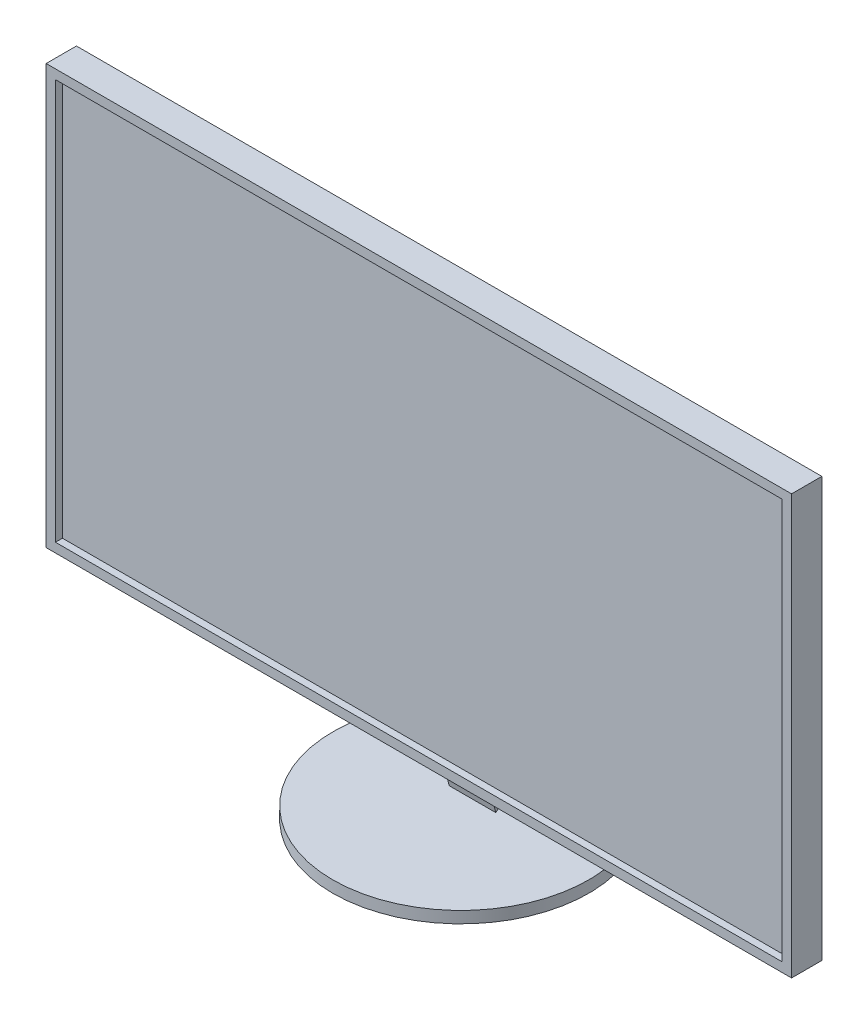
ISO-10303-21;
HEADER;
FILE_DESCRIPTION(('STEP AP214'),'2;1');
FILE_NAME('part.step','',(''),(''),'','','');
FILE_SCHEMA(('AUTOMOTIVE_DESIGN { 1 0 10303 214 1 1 1 1 }'));
ENDSEC;
DATA;
#1=APPLICATION_CONTEXT('core data for automotive mechanical design processes');
#2=APPLICATION_PROTOCOL_DEFINITION('international standard','automotive_design',2000,#1);
#3=PRODUCT_CONTEXT('',#1,'mechanical');
#4=PRODUCT('Part','Part','',(#3));
#5=PRODUCT_RELATED_PRODUCT_CATEGORY('part','',(#4));
#6=PRODUCT_DEFINITION_FORMATION('','',#4);
#7=PRODUCT_DEFINITION_CONTEXT('part definition',#1,'design');
#8=PRODUCT_DEFINITION('design','',#6,#7);
#9=PRODUCT_DEFINITION_SHAPE('','',#8);
#10=(LENGTH_UNIT() NAMED_UNIT(*) SI_UNIT(.MILLI.,.METRE.));
#11=(NAMED_UNIT(*) PLANE_ANGLE_UNIT() SI_UNIT($,.RADIAN.));
#12=(NAMED_UNIT(*) SI_UNIT($,.STERADIAN.) SOLID_ANGLE_UNIT());
#13=UNCERTAINTY_MEASURE_WITH_UNIT(LENGTH_MEASURE(1.E-05),#10,'distance_accuracy_value','');
#14=(GEOMETRIC_REPRESENTATION_CONTEXT(3) GLOBAL_UNCERTAINTY_ASSIGNED_CONTEXT((#13)) GLOBAL_UNIT_ASSIGNED_CONTEXT((#10,
#11,#12)) REPRESENTATION_CONTEXT('',''));
#15=CARTESIAN_POINT('',(0.,0.,0.));
#16=DIRECTION('',(0.,0.,1.));
#17=DIRECTION('',(1.,0.,0.));
#18=AXIS2_PLACEMENT_3D('',#15,#16,#17);
#19=CARTESIAN_POINT('',(80.,45.,2.5));
#20=DIRECTION('',(-1.,0.,0.));
#21=DIRECTION('',(0.,0.,1.));
#22=AXIS2_PLACEMENT_3D('',#19,#20,#21);
#23=PLANE('',#22);
#24=DIRECTION('',(0.,1.,0.));
#25=VECTOR('',#24,1.);
#26=CARTESIAN_POINT('',(80.,45.,-2.5));
#27=LINE('',#26,#25);
#28=CARTESIAN_POINT('',(80.,-45.,-2.5));
#29=VERTEX_POINT('',#28);
#30=CARTESIAN_POINT('',(80.,45.,-2.5));
#31=VERTEX_POINT('',#30);
#32=EDGE_CURVE('E224',#29,#31,#27,.T.);
#33=ORIENTED_EDGE('',*,*,#32,.T.);
#34=DIRECTION('',(0.,0.,-1.));
#35=VECTOR('',#34,1.);
#36=CARTESIAN_POINT('',(80.,45.,2.5));
#37=LINE('',#36,#35);
#38=CARTESIAN_POINT('',(80.,45.,4.));
#39=VERTEX_POINT('',#38);
#40=EDGE_CURVE('E12',#39,#31,#37,.T.);
#41=ORIENTED_EDGE('',*,*,#40,.F.);
#42=DIRECTION('',(0.,1.,0.));
#43=VECTOR('',#42,1.);
#44=CARTESIAN_POINT('',(80.,-45.,4.));
#45=LINE('',#44,#43);
#46=CARTESIAN_POINT('',(80.,-45.,4.));
#47=VERTEX_POINT('',#46);
#48=EDGE_CURVE('E208',#47,#39,#45,.T.);
#49=ORIENTED_EDGE('',*,*,#48,.F.);
#50=DIRECTION('',(0.,0.,-1.));
#51=VECTOR('',#50,1.);
#52=CARTESIAN_POINT('',(80.,-45.,2.5));
#53=LINE('',#52,#51);
#54=EDGE_CURVE('E237',#47,#29,#53,.T.);
#55=ORIENTED_EDGE('',*,*,#54,.T.);
#56=EDGE_LOOP('',(#33,#41,#49,#55));
#57=FACE_BOUND('',#56,.T.);
#58=ADVANCED_FACE('F45',(#57),#23,.F.);
#59=CARTESIAN_POINT('',(-80.,45.,2.5));
#60=DIRECTION('',(0.,-1.,0.));
#61=DIRECTION('',(0.,0.,-1.));
#62=AXIS2_PLACEMENT_3D('',#59,#60,#61);
#63=PLANE('',#62);
#64=DIRECTION('',(-1.,0.,0.));
#65=VECTOR('',#64,1.);
#66=CARTESIAN_POINT('',(-80.,45.,-2.5));
#67=LINE('',#66,#65);
#68=CARTESIAN_POINT('',(-80.,45.,-2.5));
#69=VERTEX_POINT('',#68);
#70=EDGE_CURVE('E228',#31,#69,#67,.T.);
#71=ORIENTED_EDGE('',*,*,#70,.T.);
#72=DIRECTION('',(0.,0.,-1.));
#73=VECTOR('',#72,1.);
#74=CARTESIAN_POINT('',(-80.,45.,2.5));
#75=LINE('',#74,#73);
#76=CARTESIAN_POINT('',(-80.,45.,4.));
#77=VERTEX_POINT('',#76);
#78=EDGE_CURVE('E54',#77,#69,#75,.T.);
#79=ORIENTED_EDGE('',*,*,#78,.F.);
#80=DIRECTION('',(-1.,0.,0.));
#81=VECTOR('',#80,1.);
#82=CARTESIAN_POINT('',(-80.,45.,4.));
#83=LINE('',#82,#81);
#84=EDGE_CURVE('E212',#39,#77,#83,.T.);
#85=ORIENTED_EDGE('',*,*,#84,.F.);
#86=ORIENTED_EDGE('',*,*,#40,.T.);
#87=EDGE_LOOP('',(#71,#79,#85,#86));
#88=FACE_BOUND('',#87,.T.);
#89=ADVANCED_FACE('F291',(#88),#63,.F.);
#90=CARTESIAN_POINT('',(-80.,45.,2.5));
#91=DIRECTION('',(1.,0.,0.));
#92=DIRECTION('',(0.,0.,-1.));
#93=AXIS2_PLACEMENT_3D('',#90,#91,#92);
#94=PLANE('',#93);
#95=DIRECTION('',(0.,-1.,0.));
#96=VECTOR('',#95,1.);
#97=CARTESIAN_POINT('',(-80.,45.,-2.5));
#98=LINE('',#97,#96);
#99=CARTESIAN_POINT('',(-80.,-45.,-2.5));
#100=VERTEX_POINT('',#99);
#101=EDGE_CURVE('E231',#69,#100,#98,.T.);
#102=ORIENTED_EDGE('',*,*,#101,.T.);
#103=DIRECTION('',(0.,0.,-1.));
#104=VECTOR('',#103,1.);
#105=CARTESIAN_POINT('',(-80.,-45.,2.5));
#106=LINE('',#105,#104);
#107=CARTESIAN_POINT('',(-80.,-45.,4.));
#108=VERTEX_POINT('',#107);
#109=EDGE_CURVE('E241',#108,#100,#106,.T.);
#110=ORIENTED_EDGE('',*,*,#109,.F.);
#111=DIRECTION('',(0.,-1.,0.));
#112=VECTOR('',#111,1.);
#113=CARTESIAN_POINT('',(-80.,-45.,4.));
#114=LINE('',#113,#112);
#115=EDGE_CURVE('E216',#77,#108,#114,.T.);
#116=ORIENTED_EDGE('',*,*,#115,.F.);
#117=ORIENTED_EDGE('',*,*,#78,.T.);
#118=EDGE_LOOP('',(#102,#110,#116,#117));
#119=FACE_BOUND('',#118,.T.);
#120=ADVANCED_FACE('F289',(#119),#94,.F.);
#121=CARTESIAN_POINT('',(-80.,-45.,2.5));
#122=DIRECTION('',(0.,1.,0.));
#123=DIRECTION('',(0.,0.,1.));
#124=AXIS2_PLACEMENT_3D('',#121,#122,#123);
#125=PLANE('',#124);
#126=DIRECTION('',(1.,0.,0.));
#127=VECTOR('',#126,1.);
#128=CARTESIAN_POINT('',(-80.,-45.,-2.5));
#129=LINE('',#128,#127);
#130=EDGE_CURVE('E234',#100,#29,#129,.T.);
#131=ORIENTED_EDGE('',*,*,#130,.T.);
#132=ORIENTED_EDGE('',*,*,#54,.F.);
#133=DIRECTION('',(1.,0.,0.));
#134=VECTOR('',#133,1.);
#135=CARTESIAN_POINT('',(-80.,-45.,4.));
#136=LINE('',#135,#134);
#137=EDGE_CURVE('E220',#108,#47,#136,.T.);
#138=ORIENTED_EDGE('',*,*,#137,.F.);
#139=ORIENTED_EDGE('',*,*,#109,.T.);
#140=EDGE_LOOP('',(#131,#132,#138,#139));
#141=FACE_BOUND('',#140,.T.);
#142=ADVANCED_FACE('F275',(#141),#125,.F.);
#143=CARTESIAN_POINT('',(0.,0.,-2.5));
#144=DIRECTION('',(0.,0.,1.));
#145=DIRECTION('',(1.,0.,0.));
#146=AXIS2_PLACEMENT_3D('',#143,#144,#145);
#147=PLANE('',#146);
#148=DIRECTION('',(0.316227766016838,-0.948683298050514,0.));
#149=VECTOR('',#148,1.);
#150=CARTESIAN_POINT('',(0.,-22.5,-2.5));
#151=LINE('',#150,#149);
#152=CARTESIAN_POINT('',(0.,-22.5,-2.5));
#153=VERTEX_POINT('',#152);
#154=CARTESIAN_POINT('',(5.,-37.5,-2.5));
#155=VERTEX_POINT('',#154);
#156=EDGE_CURVE('E150',#153,#155,#151,.T.);
#157=ORIENTED_EDGE('',*,*,#156,.F.);
#158=DIRECTION('',(0.316227766016838,0.948683298050514,0.));
#159=VECTOR('',#158,1.);
#160=CARTESIAN_POINT('',(-5.,-37.5,-2.5));
#161=LINE('',#160,#159);
#162=CARTESIAN_POINT('',(-5.,-37.5,-2.5));
#163=VERTEX_POINT('',#162);
#164=EDGE_CURVE('E248',#163,#153,#161,.T.);
#165=ORIENTED_EDGE('',*,*,#164,.F.);
#166=DIRECTION('',(-1.,0.,0.));
#167=VECTOR('',#166,1.);
#168=CARTESIAN_POINT('',(5.,-37.5,-2.5));
#169=LINE('',#168,#167);
#170=EDGE_CURVE('E156',#155,#163,#169,.T.);
#171=ORIENTED_EDGE('',*,*,#170,.F.);
#172=EDGE_LOOP('',(#157,#165,#171));
#173=FACE_BOUND('',#172,.T.);
#174=ORIENTED_EDGE('',*,*,#32,.F.);
#175=ORIENTED_EDGE('',*,*,#130,.F.);
#176=ORIENTED_EDGE('',*,*,#101,.F.);
#177=ORIENTED_EDGE('',*,*,#70,.F.);
#178=EDGE_LOOP('',(#174,#175,#176,#177));
#179=FACE_BOUND('',#178,.T.);
#180=ADVANCED_FACE('F271',(#173,#179),#147,.F.);
#181=CARTESIAN_POINT('',(0.,0.,4.));
#182=DIRECTION('',(0.,0.,-1.));
#183=DIRECTION('',(-1.,0.,0.));
#184=AXIS2_PLACEMENT_3D('',#181,#182,#183);
#185=PLANE('',#184);
#186=ORIENTED_EDGE('',*,*,#48,.T.);
#187=ORIENTED_EDGE('',*,*,#84,.T.);
#188=ORIENTED_EDGE('',*,*,#115,.T.);
#189=ORIENTED_EDGE('',*,*,#137,.T.);
#190=EDGE_LOOP('',(#186,#187,#188,#189));
#191=FACE_BOUND('',#190,.T.);
#192=DIRECTION('',(0.,1.,0.));
#193=VECTOR('',#192,1.);
#194=CARTESIAN_POINT('',(78.,43.,4.));
#195=LINE('',#194,#193);
#196=CARTESIAN_POINT('',(78.,-43.,4.));
#197=VERTEX_POINT('',#196);
#198=CARTESIAN_POINT('',(78.,43.,4.));
#199=VERTEX_POINT('',#198);
#200=EDGE_CURVE('E168',#197,#199,#195,.T.);
#201=ORIENTED_EDGE('',*,*,#200,.F.);
#202=DIRECTION('',(1.,0.,0.));
#203=VECTOR('',#202,1.);
#204=CARTESIAN_POINT('',(-78.,-43.,4.));
#205=LINE('',#204,#203);
#206=CARTESIAN_POINT('',(-78.,-43.,4.));
#207=VERTEX_POINT('',#206);
#208=EDGE_CURVE('E179',#207,#197,#205,.T.);
#209=ORIENTED_EDGE('',*,*,#208,.F.);
#210=DIRECTION('',(0.,-1.,0.));
#211=VECTOR('',#210,1.);
#212=CARTESIAN_POINT('',(-78.,43.,4.));
#213=LINE('',#212,#211);
#214=CARTESIAN_POINT('',(-78.,43.,4.));
#215=VERTEX_POINT('',#214);
#216=EDGE_CURVE('E175',#215,#207,#213,.T.);
#217=ORIENTED_EDGE('',*,*,#216,.F.);
#218=DIRECTION('',(-1.,0.,0.));
#219=VECTOR('',#218,1.);
#220=CARTESIAN_POINT('',(-78.,43.,4.));
#221=LINE('',#220,#219);
#222=EDGE_CURVE('E171',#199,#215,#221,.T.);
#223=ORIENTED_EDGE('',*,*,#222,.F.);
#224=EDGE_LOOP('',(#201,#209,#217,#223));
#225=FACE_BOUND('',#224,.T.);
#226=ADVANCED_FACE('F274',(#191,#225),#185,.F.);
#227=CARTESIAN_POINT('',(78.,43.,4.));
#228=DIRECTION('',(-1.,0.,0.));
#229=DIRECTION('',(0.,0.,1.));
#230=AXIS2_PLACEMENT_3D('',#227,#228,#229);
#231=PLANE('',#230);
#232=DIRECTION('',(0.,1.,0.));
#233=VECTOR('',#232,1.);
#234=CARTESIAN_POINT('',(78.,43.,2.5));
#235=LINE('',#234,#233);
#236=CARTESIAN_POINT('',(78.,-43.,2.5));
#237=VERTEX_POINT('',#236);
#238=CARTESIAN_POINT('',(78.,43.,2.5));
#239=VERTEX_POINT('',#238);
#240=EDGE_CURVE('E70',#237,#239,#235,.T.);
#241=ORIENTED_EDGE('',*,*,#240,.F.);
#242=DIRECTION('',(0.,0.,-1.));
#243=VECTOR('',#242,1.);
#244=CARTESIAN_POINT('',(78.,-43.,4.));
#245=LINE('',#244,#243);
#246=EDGE_CURVE('E182',#197,#237,#245,.T.);
#247=ORIENTED_EDGE('',*,*,#246,.F.);
#248=ORIENTED_EDGE('',*,*,#200,.T.);
#249=DIRECTION('',(0.,0.,-1.));
#250=VECTOR('',#249,1.);
#251=CARTESIAN_POINT('',(78.,43.,4.));
#252=LINE('',#251,#250);
#253=EDGE_CURVE('E204',#199,#239,#252,.T.);
#254=ORIENTED_EDGE('',*,*,#253,.T.);
#255=EDGE_LOOP('',(#241,#247,#248,#254));
#256=FACE_BOUND('',#255,.T.);
#257=ADVANCED_FACE('F307',(#256),#231,.T.);
#258=CARTESIAN_POINT('',(-78.,43.,4.));
#259=DIRECTION('',(0.,-1.,0.));
#260=DIRECTION('',(0.,0.,-1.));
#261=AXIS2_PLACEMENT_3D('',#258,#259,#260);
#262=PLANE('',#261);
#263=DIRECTION('',(-1.,0.,0.));
#264=VECTOR('',#263,1.);
#265=CARTESIAN_POINT('',(-78.,43.,2.5));
#266=LINE('',#265,#264);
#267=CARTESIAN_POINT('',(-78.,43.,2.5));
#268=VERTEX_POINT('',#267);
#269=EDGE_CURVE('E185',#239,#268,#266,.T.);
#270=ORIENTED_EDGE('',*,*,#269,.F.);
#271=ORIENTED_EDGE('',*,*,#253,.F.);
#272=ORIENTED_EDGE('',*,*,#222,.T.);
#273=DIRECTION('',(0.,0.,-1.));
#274=VECTOR('',#273,1.);
#275=CARTESIAN_POINT('',(-78.,43.,4.));
#276=LINE('',#275,#274);
#277=EDGE_CURVE('E200',#215,#268,#276,.T.);
#278=ORIENTED_EDGE('',*,*,#277,.T.);
#279=EDGE_LOOP('',(#270,#271,#272,#278));
#280=FACE_BOUND('',#279,.T.);
#281=ADVANCED_FACE('F310',(#280),#262,.T.);
#282=CARTESIAN_POINT('',(-78.,43.,4.));
#283=DIRECTION('',(1.,0.,0.));
#284=DIRECTION('',(0.,0.,-1.));
#285=AXIS2_PLACEMENT_3D('',#282,#283,#284);
#286=PLANE('',#285);
#287=DIRECTION('',(0.,-1.,0.));
#288=VECTOR('',#287,1.);
#289=CARTESIAN_POINT('',(-78.,43.,2.5));
#290=LINE('',#289,#288);
#291=CARTESIAN_POINT('',(-78.,-43.,2.5));
#292=VERTEX_POINT('',#291);
#293=EDGE_CURVE('E188',#268,#292,#290,.T.);
#294=ORIENTED_EDGE('',*,*,#293,.F.);
#295=ORIENTED_EDGE('',*,*,#277,.F.);
#296=ORIENTED_EDGE('',*,*,#216,.T.);
#297=DIRECTION('',(0.,0.,-1.));
#298=VECTOR('',#297,1.);
#299=CARTESIAN_POINT('',(-78.,-43.,4.));
#300=LINE('',#299,#298);
#301=EDGE_CURVE('E196',#207,#292,#300,.T.);
#302=ORIENTED_EDGE('',*,*,#301,.T.);
#303=EDGE_LOOP('',(#294,#295,#296,#302));
#304=FACE_BOUND('',#303,.T.);
#305=ADVANCED_FACE('F314',(#304),#286,.T.);
#306=CARTESIAN_POINT('',(-78.,-43.,4.));
#307=DIRECTION('',(0.,1.,0.));
#308=DIRECTION('',(0.,0.,1.));
#309=AXIS2_PLACEMENT_3D('',#306,#307,#308);
#310=PLANE('',#309);
#311=DIRECTION('',(1.,0.,0.));
#312=VECTOR('',#311,1.);
#313=CARTESIAN_POINT('',(-78.,-43.,2.5));
#314=LINE('',#313,#312);
#315=EDGE_CURVE('E172',#292,#237,#314,.T.);
#316=ORIENTED_EDGE('',*,*,#315,.F.);
#317=ORIENTED_EDGE('',*,*,#301,.F.);
#318=ORIENTED_EDGE('',*,*,#208,.T.);
#319=ORIENTED_EDGE('',*,*,#246,.T.);
#320=EDGE_LOOP('',(#316,#317,#318,#319));
#321=FACE_BOUND('',#320,.T.);
#322=ADVANCED_FACE('F304',(#321),#310,.T.);
#323=CARTESIAN_POINT('',(0.,0.,2.5));
#324=DIRECTION('',(0.,0.,1.));
#325=DIRECTION('',(1.,0.,0.));
#326=AXIS2_PLACEMENT_3D('',#323,#324,#325);
#327=PLANE('',#326);
#328=ORIENTED_EDGE('',*,*,#240,.T.);
#329=ORIENTED_EDGE('',*,*,#269,.T.);
#330=ORIENTED_EDGE('',*,*,#293,.T.);
#331=ORIENTED_EDGE('',*,*,#315,.T.);
#332=EDGE_LOOP('',(#328,#329,#330,#331));
#333=FACE_BOUND('',#332,.T.);
#334=ADVANCED_FACE('F301',(#333),#327,.T.);
#335=CARTESIAN_POINT('',(0.,-1.61764705882353,6.47058823529412));
#336=DIRECTION('',(0.,-0.242535625036333,0.970142500145332));
#337=DIRECTION('',(0.,-0.970142500145332,-0.242535625036333));
#338=AXIS2_PLACEMENT_3D('',#335,#336,#337);
#339=PLANE('',#338);
#340=DIRECTION('',(0.,-0.970142500145332,-0.242535625036333));
#341=VECTOR('',#340,1.);
#342=CARTESIAN_POINT('',(-5.,-37.5,-2.5));
#343=LINE('',#342,#341);
#344=CARTESIAN_POINT('',(-5.,-57.5,-7.5));
#345=VERTEX_POINT('',#344);
#346=EDGE_CURVE('E146',#163,#345,#343,.T.);
#347=ORIENTED_EDGE('',*,*,#346,.T.);
#348=DIRECTION('',(1.,0.,0.));
#349=VECTOR('',#348,1.);
#350=CARTESIAN_POINT('',(5.,-57.5,-7.5));
#351=LINE('',#350,#349);
#352=CARTESIAN_POINT('',(5.,-57.5,-7.5));
#353=VERTEX_POINT('',#352);
#354=EDGE_CURVE('E133',#345,#353,#351,.T.);
#355=ORIENTED_EDGE('',*,*,#354,.T.);
#356=DIRECTION('',(0.,-0.970142500145332,-0.242535625036333));
#357=VECTOR('',#356,1.);
#358=CARTESIAN_POINT('',(5.,-37.5,-2.5));
#359=LINE('',#358,#357);
#360=EDGE_CURVE('E144',#155,#353,#359,.T.);
#361=ORIENTED_EDGE('',*,*,#360,.F.);
#362=ORIENTED_EDGE('',*,*,#170,.T.);
#363=EDGE_LOOP('',(#347,#355,#361,#362));
#364=FACE_BOUND('',#363,.T.);
#365=ADVANCED_FACE('F142',(#364),#339,.T.);
#366=CARTESIAN_POINT('',(0.,-22.5,-2.5));
#367=CARTESIAN_POINT('',(0.,-57.5,-19.5));
#368=CARTESIAN_POINT('',(0.833333333333331,-25.,-2.5));
#369=CARTESIAN_POINT('',(0.833333333333304,-57.5,-17.5000000000001));
#370=CARTESIAN_POINT('',(1.66666666666666,-27.5,-2.5));
#371=CARTESIAN_POINT('',(1.66666666666662,-57.5,-15.5000000000001));
#372=CARTESIAN_POINT('',(3.33333333333333,-32.5,-2.5));
#373=CARTESIAN_POINT('',(3.33333333333329,-57.5,-11.5000000000001));
#374=CARTESIAN_POINT('',(4.16666666666666,-35.,-2.5));
#375=CARTESIAN_POINT('',(4.16666666666664,-57.5,-9.50000000000007));
#376=CARTESIAN_POINT('',(5.,-37.5,-2.5));
#377=CARTESIAN_POINT('',(5.,-57.5,-7.5));
#378=B_SPLINE_SURFACE_WITH_KNOTS('',3,1,((#366,#367),(#368,#369),(#370,#371),(#372,#373),(#374,
#375),(#376,#377)),.UNSPECIFIED.,.F.,.F.,.F.,(4,2,4),(2,2),(0.,0.5,1.),(0.,1.),.UNSPECIFIED.);
#379=DIRECTION('',(-0.384615384615385,0.,-0.923076923076923));
#380=VECTOR('',#379,1.);
#381=CARTESIAN_POINT('',(0.,-57.5,-19.5));
#382=LINE('',#381,#380);
#383=CARTESIAN_POINT('',(0.,-57.5,-19.5));
#384=VERTEX_POINT('',#383);
#385=EDGE_CURVE('E129',#353,#384,#382,.T.);
#386=DIRECTION('',(0.,-0.899508158575998,-0.436903962736913));
#387=VECTOR('',#386,1.);
#388=CARTESIAN_POINT('',(0.,-40.,-11.));
#389=LINE('',#388,#387);
#390=EDGE_CURVE('E62',#153,#384,#389,.T.);
#391=ORIENTED_EDGE('',*,*,#156,.T.);
#392=ORIENTED_EDGE('',*,*,#360,.T.);
#393=ORIENTED_EDGE('',*,*,#385,.T.);
#394=ORIENTED_EDGE('',*,*,#390,.F.);
#395=EDGE_LOOP('',(#391,#392,#393,#394));
#396=FACE_BOUND('',#395,.T.);
#397=ADVANCED_FACE('F148',(#396),#378,.T.);
#398=CARTESIAN_POINT('',(-5.,-37.5,-2.5));
#399=CARTESIAN_POINT('',(-5.,-57.5,-7.5));
#400=CARTESIAN_POINT('',(-4.16666666666666,-35.,-2.5));
#401=CARTESIAN_POINT('',(-4.16666666666667,-57.5,-9.49999999999999));
#402=CARTESIAN_POINT('',(-3.33333333333332,-32.5,-2.5));
#403=CARTESIAN_POINT('',(-3.33333333333334,-57.5,-11.5));
#404=CARTESIAN_POINT('',(-1.66666666666665,-27.4999999999999,-2.5));
#405=CARTESIAN_POINT('',(-1.66666666666667,-57.5,-15.5));
#406=CARTESIAN_POINT('',(-0.833333333333323,-25.,-2.5));
#407=CARTESIAN_POINT('',(-0.833333333333338,-57.5,-17.5));
#408=CARTESIAN_POINT('',(0.,-22.5,-2.5));
#409=CARTESIAN_POINT('',(0.,-57.5,-19.5));
#410=B_SPLINE_SURFACE_WITH_KNOTS('',3,1,((#398,#399),(#400,#401),(#402,#403),(#404,#405),(#406,
#407),(#408,#409)),.UNSPECIFIED.,.F.,.F.,.F.,(4,2,4),(2,2),(0.,0.5,1.),(0.,1.),.UNSPECIFIED.);
#411=DIRECTION('',(-0.384615384615385,0.,0.923076923076923));
#412=VECTOR('',#411,1.);
#413=CARTESIAN_POINT('',(-5.,-57.5,-7.5));
#414=LINE('',#413,#412);
#415=EDGE_CURVE('E135',#384,#345,#414,.T.);
#416=ORIENTED_EDGE('',*,*,#164,.T.);
#417=ORIENTED_EDGE('',*,*,#390,.T.);
#418=ORIENTED_EDGE('',*,*,#415,.T.);
#419=ORIENTED_EDGE('',*,*,#346,.F.);
#420=EDGE_LOOP('',(#416,#417,#418,#419));
#421=FACE_BOUND('',#420,.T.);
#422=ADVANCED_FACE('F268',(#421),#410,.T.);
#423=CARTESIAN_POINT('',(0.,-57.5,-5.));
#424=DIRECTION('',(0.,-1.,0.));
#425=DIRECTION('',(0.,0.,-1.));
#426=AXIS2_PLACEMENT_3D('',#423,#424,#425);
#427=CYLINDRICAL_SURFACE('',#426,27.5);
#428=CARTESIAN_POINT('',(0.,-57.5,-5.));
#429=DIRECTION('',(0.,1.,0.));
#430=DIRECTION('',(0.,0.,1.));
#431=AXIS2_PLACEMENT_3D('',#428,#429,#430);
#432=CIRCLE('',#431,27.5);
#433=CARTESIAN_POINT('',(0.,-57.5,22.5));
#434=VERTEX_POINT('',#433);
#435=EDGE_CURVE('E251',#434,#434,#432,.T.);
#436=ORIENTED_EDGE('',*,*,#435,.F.);
#437=EDGE_LOOP('',(#436));
#438=FACE_BOUND('',#437,.T.);
#439=CARTESIAN_POINT('',(0.,-60.,-5.));
#440=DIRECTION('',(0.,1.,0.));
#441=DIRECTION('',(0.,0.,1.));
#442=AXIS2_PLACEMENT_3D('',#439,#440,#441);
#443=CIRCLE('',#442,27.5);
#444=CARTESIAN_POINT('',(0.,-60.,22.5));
#445=VERTEX_POINT('',#444);
#446=EDGE_CURVE('E160',#445,#445,#443,.T.);
#447=ORIENTED_EDGE('',*,*,#446,.T.);
#448=EDGE_LOOP('',(#447));
#449=FACE_BOUND('',#448,.T.);
#450=ADVANCED_FACE('F326',(#438,#449),#427,.T.);
#451=CARTESIAN_POINT('',(0.,-57.5,-5.));
#452=DIRECTION('',(0.,1.,0.));
#453=DIRECTION('',(0.,0.,1.));
#454=AXIS2_PLACEMENT_3D('',#451,#452,#453);
#455=PLANE('',#454);
#456=ORIENTED_EDGE('',*,*,#385,.F.);
#457=ORIENTED_EDGE('',*,*,#354,.F.);
#458=ORIENTED_EDGE('',*,*,#415,.F.);
#459=EDGE_LOOP('',(#456,#457,#458));
#460=FACE_BOUND('',#459,.T.);
#461=ORIENTED_EDGE('',*,*,#435,.T.);
#462=EDGE_LOOP('',(#461));
#463=FACE_BOUND('',#462,.T.);
#464=ADVANCED_FACE('F131',(#460,#463),#455,.T.);
#465=CARTESIAN_POINT('',(0.,-60.,-5.));
#466=DIRECTION('',(0.,1.,0.));
#467=DIRECTION('',(0.,0.,1.));
#468=AXIS2_PLACEMENT_3D('',#465,#466,#467);
#469=PLANE('',#468);
#470=ORIENTED_EDGE('',*,*,#446,.F.);
#471=EDGE_LOOP('',(#470));
#472=FACE_BOUND('',#471,.T.);
#473=ADVANCED_FACE('F346',(#472),#469,.F.);
#474=CLOSED_SHELL('',(#58,#89,#120,#142,#180,#226,#257,#281,#305,#322,#334,#365,#397,#422,#450,
#464,#473));
#475=MANIFOLD_SOLID_BREP('B2',#474);
#476=ADVANCED_BREP_SHAPE_REPRESENTATION('',(#18,#475),#14);
#477=SHAPE_DEFINITION_REPRESENTATION(#9,#476);
ENDSEC;
END-ISO-10303-21;
